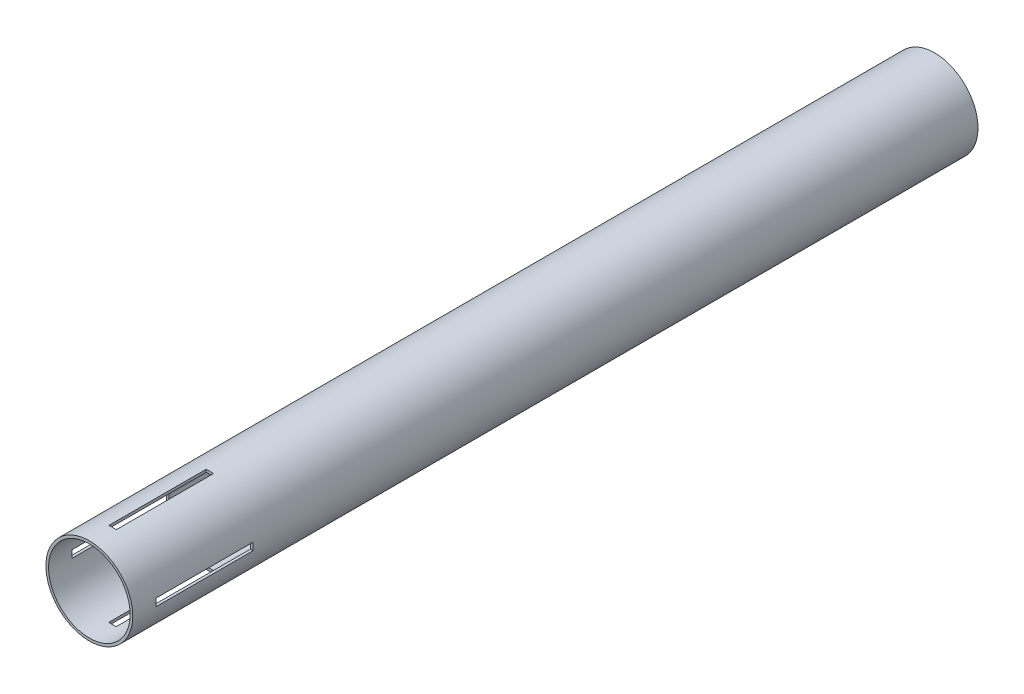
ISO-10303-21;
HEADER;
FILE_DESCRIPTION(('STEP AP214'),'2;1');
FILE_NAME('part.step','',(''),(''),'','','');
FILE_SCHEMA(('AUTOMOTIVE_DESIGN { 1 0 10303 214 1 1 1 1 }'));
ENDSEC;
DATA;
#1=APPLICATION_CONTEXT('core data for automotive mechanical design processes');
#2=APPLICATION_PROTOCOL_DEFINITION('international standard','automotive_design',2000,#1);
#3=PRODUCT_CONTEXT('',#1,'mechanical');
#4=PRODUCT('Part','Part','',(#3));
#5=PRODUCT_RELATED_PRODUCT_CATEGORY('part','',(#4));
#6=PRODUCT_DEFINITION_FORMATION('','',#4);
#7=PRODUCT_DEFINITION_CONTEXT('part definition',#1,'design');
#8=PRODUCT_DEFINITION('design','',#6,#7);
#9=PRODUCT_DEFINITION_SHAPE('','',#8);
#10=(LENGTH_UNIT() NAMED_UNIT(*) SI_UNIT(.MILLI.,.METRE.));
#11=(NAMED_UNIT(*) PLANE_ANGLE_UNIT() SI_UNIT($,.RADIAN.));
#12=(NAMED_UNIT(*) SI_UNIT($,.STERADIAN.) SOLID_ANGLE_UNIT());
#13=UNCERTAINTY_MEASURE_WITH_UNIT(LENGTH_MEASURE(1.E-05),#10,'distance_accuracy_value','');
#14=(GEOMETRIC_REPRESENTATION_CONTEXT(3) GLOBAL_UNCERTAINTY_ASSIGNED_CONTEXT((#13)) GLOBAL_UNIT_ASSIGNED_CONTEXT((#10,
#11,#12)) REPRESENTATION_CONTEXT('',''));
#15=CARTESIAN_POINT('',(0.,0.,0.));
#16=DIRECTION('',(0.,0.,1.));
#17=DIRECTION('',(1.,0.,0.));
#18=AXIS2_PLACEMENT_3D('',#15,#16,#17);
#19=CARTESIAN_POINT('',(0.,0.,-400.));
#20=DIRECTION('',(0.,0.,1.));
#21=DIRECTION('',(1.,0.,0.));
#22=AXIS2_PLACEMENT_3D('',#19,#20,#21);
#23=CYLINDRICAL_SURFACE('',#22,20.555);
#24=CARTESIAN_POINT('',(0.,0.,-57.));
#25=DIRECTION('',(0.,0.,-1.));
#26=DIRECTION('',(-1.,0.,0.));
#27=AXIS2_PLACEMENT_3D('',#24,#25,#26);
#28=CIRCLE('',#27,20.555);
#29=CARTESIAN_POINT('',(-20.4803692593664,1.75000000000008,-57.));
#30=VERTEX_POINT('',#29);
#31=CARTESIAN_POINT('',(-20.4803692593664,-1.74999999999992,-57.));
#32=VERTEX_POINT('',#31);
#33=EDGE_CURVE('E54',#30,#32,#28,.F.);
#34=ORIENTED_EDGE('',*,*,#33,.F.);
#35=DIRECTION('',(0.,0.,1.));
#36=VECTOR('',#35,1.);
#37=CARTESIAN_POINT('',(-20.4803692593664,1.75000000000017,-400.));
#38=LINE('',#37,#36);
#39=CARTESIAN_POINT('',(-20.4803692593664,1.75000000000007,-11.));
#40=VERTEX_POINT('',#39);
#41=EDGE_CURVE('E171',#40,#30,#38,.F.);
#42=ORIENTED_EDGE('',*,*,#41,.F.);
#43=CARTESIAN_POINT('',(0.,0.,-11.));
#44=DIRECTION('',(0.,0.,1.));
#45=DIRECTION('',(0.,-1.,0.));
#46=AXIS2_PLACEMENT_3D('',#43,#44,#45);
#47=CIRCLE('',#46,20.555);
#48=CARTESIAN_POINT('',(-20.4803692593664,-1.74999999999993,-11.));
#49=VERTEX_POINT('',#48);
#50=EDGE_CURVE('E208',#49,#40,#47,.F.);
#51=ORIENTED_EDGE('',*,*,#50,.F.);
#52=DIRECTION('',(0.,0.,1.));
#53=VECTOR('',#52,1.);
#54=CARTESIAN_POINT('',(-20.4803692593664,-1.74999999999983,-400.));
#55=LINE('',#54,#53);
#56=EDGE_CURVE('E210',#32,#49,#55,.T.);
#57=ORIENTED_EDGE('',*,*,#56,.F.);
#58=EDGE_LOOP('',(#34,#42,#51,#57));
#59=FACE_BOUND('',#58,.T.);
#60=CARTESIAN_POINT('',(20.4803692593664,-1.75000000000006,-57.));
#61=VERTEX_POINT('',#60);
#62=CARTESIAN_POINT('',(20.4803692593664,1.74999999999994,-57.));
#63=VERTEX_POINT('',#62);
#64=EDGE_CURVE('E202',#61,#63,#28,.F.);
#65=ORIENTED_EDGE('',*,*,#64,.F.);
#66=DIRECTION('',(0.,0.,1.));
#67=VECTOR('',#66,1.);
#68=CARTESIAN_POINT('',(20.4803692593664,-1.74999999999997,-400.));
#69=LINE('',#68,#67);
#70=CARTESIAN_POINT('',(20.4803692593664,-1.75000000000007,-11.));
#71=VERTEX_POINT('',#70);
#72=EDGE_CURVE('E198',#71,#61,#69,.F.);
#73=ORIENTED_EDGE('',*,*,#72,.F.);
#74=CARTESIAN_POINT('',(20.4803692593664,1.74999999999993,-11.));
#75=VERTEX_POINT('',#74);
#76=EDGE_CURVE('E207',#75,#71,#47,.F.);
#77=ORIENTED_EDGE('',*,*,#76,.F.);
#78=DIRECTION('',(0.,0.,1.));
#79=VECTOR('',#78,1.);
#80=CARTESIAN_POINT('',(20.4803692593664,1.75000000000003,-400.));
#81=LINE('',#80,#79);
#82=EDGE_CURVE('E204',#63,#75,#81,.T.);
#83=ORIENTED_EDGE('',*,*,#82,.F.);
#84=EDGE_LOOP('',(#65,#73,#77,#83));
#85=FACE_BOUND('',#84,.T.);
#86=CARTESIAN_POINT('',(0.,0.,-57.));
#87=DIRECTION('',(0.,0.,-1.));
#88=DIRECTION('',(-1.,0.,0.));
#89=AXIS2_PLACEMENT_3D('',#86,#87,#88);
#90=CIRCLE('',#89,20.555);
#91=CARTESIAN_POINT('',(-1.75000000000001,-20.4803692593664,-57.));
#92=VERTEX_POINT('',#91);
#93=CARTESIAN_POINT('',(1.74999999999999,-20.4803692593664,-57.));
#94=VERTEX_POINT('',#93);
#95=EDGE_CURVE('E229',#92,#94,#90,.F.);
#96=ORIENTED_EDGE('',*,*,#95,.F.);
#97=DIRECTION('',(0.,0.,1.));
#98=VECTOR('',#97,1.);
#99=CARTESIAN_POINT('',(-1.7500000000001,-20.4803692593664,-400.));
#100=LINE('',#99,#98);
#101=CARTESIAN_POINT('',(-1.75,-20.4803692593664,-11.));
#102=VERTEX_POINT('',#101);
#103=EDGE_CURVE('E234',#102,#92,#100,.F.);
#104=ORIENTED_EDGE('',*,*,#103,.F.);
#105=CARTESIAN_POINT('',(0.,0.,-11.));
#106=DIRECTION('',(0.,0.,1.));
#107=DIRECTION('',(1.,0.,0.));
#108=AXIS2_PLACEMENT_3D('',#105,#106,#107);
#109=CIRCLE('',#108,20.555);
#110=CARTESIAN_POINT('',(1.75,-20.4803692593664,-11.));
#111=VERTEX_POINT('',#110);
#112=EDGE_CURVE('E237',#111,#102,#109,.F.);
#113=ORIENTED_EDGE('',*,*,#112,.F.);
#114=DIRECTION('',(0.,0.,1.));
#115=VECTOR('',#114,1.);
#116=CARTESIAN_POINT('',(1.7499999999999,-20.4803692593664,-400.));
#117=LINE('',#116,#115);
#118=EDGE_CURVE('E239',#94,#111,#117,.T.);
#119=ORIENTED_EDGE('',*,*,#118,.F.);
#120=EDGE_LOOP('',(#96,#104,#113,#119));
#121=FACE_BOUND('',#120,.T.);
#122=CARTESIAN_POINT('',(1.74999999999999,20.4803692593664,-57.));
#123=VERTEX_POINT('',#122);
#124=CARTESIAN_POINT('',(-1.75000000000001,20.4803692593664,-57.));
#125=VERTEX_POINT('',#124);
#126=EDGE_CURVE('E232',#123,#125,#90,.F.);
#127=ORIENTED_EDGE('',*,*,#126,.F.);
#128=DIRECTION('',(0.,0.,1.));
#129=VECTOR('',#128,1.);
#130=CARTESIAN_POINT('',(1.7499999999999,20.4803692593664,-400.));
#131=LINE('',#130,#129);
#132=CARTESIAN_POINT('',(1.75,20.4803692593664,-11.));
#133=VERTEX_POINT('',#132);
#134=EDGE_CURVE('E241',#133,#123,#131,.F.);
#135=ORIENTED_EDGE('',*,*,#134,.F.);
#136=CARTESIAN_POINT('',(-1.75,20.4803692593664,-11.));
#137=VERTEX_POINT('',#136);
#138=EDGE_CURVE('E236',#137,#133,#109,.F.);
#139=ORIENTED_EDGE('',*,*,#138,.F.);
#140=DIRECTION('',(0.,0.,1.));
#141=VECTOR('',#140,1.);
#142=CARTESIAN_POINT('',(-1.7500000000001,20.4803692593664,-400.));
#143=LINE('',#142,#141);
#144=EDGE_CURVE('E231',#125,#137,#143,.T.);
#145=ORIENTED_EDGE('',*,*,#144,.F.);
#146=EDGE_LOOP('',(#127,#135,#139,#145));
#147=FACE_BOUND('',#146,.T.);
#148=CARTESIAN_POINT('',(0.,0.,-400.));
#149=DIRECTION('',(0.,0.,1.));
#150=DIRECTION('',(1.,0.,0.));
#151=AXIS2_PLACEMENT_3D('',#148,#149,#150);
#152=CIRCLE('',#151,20.555);
#153=CARTESIAN_POINT('',(20.555,0.,-400.));
#154=VERTEX_POINT('',#153);
#155=EDGE_CURVE('E250',#154,#154,#152,.T.);
#156=ORIENTED_EDGE('',*,*,#155,.T.);
#157=EDGE_LOOP('',(#156));
#158=FACE_BOUND('',#157,.T.);
#159=CARTESIAN_POINT('',(0.,0.,0.));
#160=DIRECTION('',(0.,0.,1.));
#161=DIRECTION('',(1.,0.,0.));
#162=AXIS2_PLACEMENT_3D('',#159,#160,#161);
#163=CIRCLE('',#162,20.555);
#164=CARTESIAN_POINT('',(20.555,0.,0.));
#165=VERTEX_POINT('',#164);
#166=EDGE_CURVE('E247',#165,#165,#163,.T.);
#167=ORIENTED_EDGE('',*,*,#166,.F.);
#168=EDGE_LOOP('',(#167));
#169=FACE_BOUND('',#168,.T.);
#170=ADVANCED_FACE('F40',(#59,#85,#121,#147,#158,#169),#23,.T.);
#171=CARTESIAN_POINT('',(0.,0.,-400.));
#172=DIRECTION('',(0.,0.,1.));
#173=DIRECTION('',(1.,0.,0.));
#174=AXIS2_PLACEMENT_3D('',#171,#172,#173);
#175=PLANE('',#174);
#176=CARTESIAN_POINT('',(0.,0.,-400.));
#177=DIRECTION('',(0.,0.,1.));
#178=DIRECTION('',(1.,0.,0.));
#179=AXIS2_PLACEMENT_3D('',#176,#177,#178);
#180=CIRCLE('',#179,19.305);
#181=CARTESIAN_POINT('',(19.305,0.,-400.));
#182=VERTEX_POINT('',#181);
#183=EDGE_CURVE('E244',#182,#182,#180,.T.);
#184=ORIENTED_EDGE('',*,*,#183,.T.);
#185=EDGE_LOOP('',(#184));
#186=FACE_BOUND('',#185,.T.);
#187=ORIENTED_EDGE('',*,*,#155,.F.);
#188=EDGE_LOOP('',(#187));
#189=FACE_BOUND('',#188,.T.);
#190=ADVANCED_FACE('F315',(#186,#189),#175,.F.);
#191=CARTESIAN_POINT('',(0.,0.,0.));
#192=DIRECTION('',(0.,0.,1.));
#193=DIRECTION('',(1.,0.,0.));
#194=AXIS2_PLACEMENT_3D('',#191,#192,#193);
#195=PLANE('',#194);
#196=CARTESIAN_POINT('',(0.,0.,0.));
#197=DIRECTION('',(0.,0.,1.));
#198=DIRECTION('',(1.,0.,0.));
#199=AXIS2_PLACEMENT_3D('',#196,#197,#198);
#200=CIRCLE('',#199,19.305);
#201=CARTESIAN_POINT('',(19.305,0.,0.));
#202=VERTEX_POINT('',#201);
#203=EDGE_CURVE('E243',#202,#202,#200,.T.);
#204=ORIENTED_EDGE('',*,*,#203,.F.);
#205=EDGE_LOOP('',(#204));
#206=FACE_BOUND('',#205,.T.);
#207=ORIENTED_EDGE('',*,*,#166,.T.);
#208=EDGE_LOOP('',(#207));
#209=FACE_BOUND('',#208,.T.);
#210=ADVANCED_FACE('F307',(#206,#209),#195,.T.);
#211=CARTESIAN_POINT('',(0.,0.,-400.));
#212=DIRECTION('',(0.,0.,1.));
#213=DIRECTION('',(1.,0.,0.));
#214=AXIS2_PLACEMENT_3D('',#211,#212,#213);
#215=CYLINDRICAL_SURFACE('',#214,19.305);
#216=CARTESIAN_POINT('',(0.,0.,-11.));
#217=DIRECTION('',(0.,0.,1.));
#218=DIRECTION('',(0.,-1.,0.));
#219=AXIS2_PLACEMENT_3D('',#216,#217,#218);
#220=CIRCLE('',#219,19.305);
#221=CARTESIAN_POINT('',(19.2255175483002,1.74999999999993,-11.));
#222=VERTEX_POINT('',#221);
#223=CARTESIAN_POINT('',(19.2255175483002,-1.75000000000007,-11.));
#224=VERTEX_POINT('',#223);
#225=EDGE_CURVE('E47',#222,#224,#220,.F.);
#226=ORIENTED_EDGE('',*,*,#225,.T.);
#227=DIRECTION('',(0.,0.,1.));
#228=VECTOR('',#227,1.);
#229=CARTESIAN_POINT('',(19.2255175483002,-1.74999999999997,-400.));
#230=LINE('',#229,#228);
#231=CARTESIAN_POINT('',(19.2255175483002,-1.75000000000006,-57.));
#232=VERTEX_POINT('',#231);
#233=EDGE_CURVE('E11',#224,#232,#230,.F.);
#234=ORIENTED_EDGE('',*,*,#233,.T.);
#235=CARTESIAN_POINT('',(0.,0.,-57.));
#236=DIRECTION('',(0.,0.,-1.));
#237=DIRECTION('',(-1.,0.,0.));
#238=AXIS2_PLACEMENT_3D('',#235,#236,#237);
#239=CIRCLE('',#238,19.305);
#240=CARTESIAN_POINT('',(19.2255175483002,1.74999999999994,-57.));
#241=VERTEX_POINT('',#240);
#242=EDGE_CURVE('E166',#232,#241,#239,.F.);
#243=ORIENTED_EDGE('',*,*,#242,.T.);
#244=DIRECTION('',(0.,0.,1.));
#245=VECTOR('',#244,1.);
#246=CARTESIAN_POINT('',(19.2255175483002,1.75000000000003,-400.));
#247=LINE('',#246,#245);
#248=EDGE_CURVE('E183',#241,#222,#247,.T.);
#249=ORIENTED_EDGE('',*,*,#248,.T.);
#250=EDGE_LOOP('',(#226,#234,#243,#249));
#251=FACE_BOUND('',#250,.T.);
#252=CARTESIAN_POINT('',(-19.2255175483002,1.75000000000008,-57.));
#253=VERTEX_POINT('',#252);
#254=CARTESIAN_POINT('',(-19.2255175483002,-1.74999999999992,-57.));
#255=VERTEX_POINT('',#254);
#256=EDGE_CURVE('E152',#253,#255,#239,.F.);
#257=ORIENTED_EDGE('',*,*,#256,.T.);
#258=DIRECTION('',(0.,0.,1.));
#259=VECTOR('',#258,1.);
#260=CARTESIAN_POINT('',(-19.2255175483002,-1.74999999999984,-400.));
#261=LINE('',#260,#259);
#262=CARTESIAN_POINT('',(-19.2255175483002,-1.74999999999993,-11.));
#263=VERTEX_POINT('',#262);
#264=EDGE_CURVE('E179',#255,#263,#261,.T.);
#265=ORIENTED_EDGE('',*,*,#264,.T.);
#266=CARTESIAN_POINT('',(-19.2255175483002,1.75000000000007,-11.));
#267=VERTEX_POINT('',#266);
#268=EDGE_CURVE('E177',#263,#267,#220,.F.);
#269=ORIENTED_EDGE('',*,*,#268,.T.);
#270=DIRECTION('',(0.,0.,1.));
#271=VECTOR('',#270,1.);
#272=CARTESIAN_POINT('',(-19.2255175483002,1.75000000000016,-400.));
#273=LINE('',#272,#271);
#274=EDGE_CURVE('E163',#267,#253,#273,.F.);
#275=ORIENTED_EDGE('',*,*,#274,.T.);
#276=EDGE_LOOP('',(#257,#265,#269,#275));
#277=FACE_BOUND('',#276,.T.);
#278=CARTESIAN_POINT('',(0.,0.,-57.));
#279=DIRECTION('',(0.,0.,-1.));
#280=DIRECTION('',(-1.,0.,0.));
#281=AXIS2_PLACEMENT_3D('',#278,#279,#280);
#282=CIRCLE('',#281,19.305);
#283=CARTESIAN_POINT('',(-1.75000000000001,-19.2255175483002,-57.));
#284=VERTEX_POINT('',#283);
#285=CARTESIAN_POINT('',(1.74999999999999,-19.2255175483002,-57.));
#286=VERTEX_POINT('',#285);
#287=EDGE_CURVE('E259',#284,#286,#282,.F.);
#288=ORIENTED_EDGE('',*,*,#287,.T.);
#289=DIRECTION('',(0.,0.,1.));
#290=VECTOR('',#289,1.);
#291=CARTESIAN_POINT('',(1.7499999999999,-19.2255175483002,-400.));
#292=LINE('',#291,#290);
#293=CARTESIAN_POINT('',(1.75,-19.2255175483002,-11.));
#294=VERTEX_POINT('',#293);
#295=EDGE_CURVE('E164',#286,#294,#292,.T.);
#296=ORIENTED_EDGE('',*,*,#295,.T.);
#297=CARTESIAN_POINT('',(0.,0.,-11.));
#298=DIRECTION('',(0.,0.,1.));
#299=DIRECTION('',(1.,0.,0.));
#300=AXIS2_PLACEMENT_3D('',#297,#298,#299);
#301=CIRCLE('',#300,19.305);
#302=CARTESIAN_POINT('',(-1.75,-19.2255175483002,-11.));
#303=VERTEX_POINT('',#302);
#304=EDGE_CURVE('E266',#294,#303,#301,.F.);
#305=ORIENTED_EDGE('',*,*,#304,.T.);
#306=DIRECTION('',(0.,0.,1.));
#307=VECTOR('',#306,1.);
#308=CARTESIAN_POINT('',(-1.7500000000001,-19.2255175483002,-400.));
#309=LINE('',#308,#307);
#310=EDGE_CURVE('E269',#303,#284,#309,.F.);
#311=ORIENTED_EDGE('',*,*,#310,.T.);
#312=EDGE_LOOP('',(#288,#296,#305,#311));
#313=FACE_BOUND('',#312,.T.);
#314=CARTESIAN_POINT('',(-1.75,19.2255175483002,-11.));
#315=VERTEX_POINT('',#314);
#316=CARTESIAN_POINT('',(1.75,19.2255175483002,-11.));
#317=VERTEX_POINT('',#316);
#318=EDGE_CURVE('E262',#315,#317,#301,.F.);
#319=ORIENTED_EDGE('',*,*,#318,.T.);
#320=DIRECTION('',(0.,0.,1.));
#321=VECTOR('',#320,1.);
#322=CARTESIAN_POINT('',(1.7499999999999,19.2255175483002,-400.));
#323=LINE('',#322,#321);
#324=CARTESIAN_POINT('',(1.74999999999999,19.2255175483002,-57.));
#325=VERTEX_POINT('',#324);
#326=EDGE_CURVE('E265',#317,#325,#323,.F.);
#327=ORIENTED_EDGE('',*,*,#326,.T.);
#328=CARTESIAN_POINT('',(-1.75000000000001,19.2255175483002,-57.));
#329=VERTEX_POINT('',#328);
#330=EDGE_CURVE('E253',#325,#329,#282,.F.);
#331=ORIENTED_EDGE('',*,*,#330,.T.);
#332=DIRECTION('',(0.,0.,1.));
#333=VECTOR('',#332,1.);
#334=CARTESIAN_POINT('',(-1.7500000000001,19.2255175483002,-400.));
#335=LINE('',#334,#333);
#336=EDGE_CURVE('E258',#329,#315,#335,.T.);
#337=ORIENTED_EDGE('',*,*,#336,.T.);
#338=EDGE_LOOP('',(#319,#327,#331,#337));
#339=FACE_BOUND('',#338,.T.);
#340=ORIENTED_EDGE('',*,*,#183,.F.);
#341=EDGE_LOOP('',(#340));
#342=FACE_BOUND('',#341,.T.);
#343=ORIENTED_EDGE('',*,*,#203,.T.);
#344=EDGE_LOOP('',(#343));
#345=FACE_BOUND('',#344,.T.);
#346=ADVANCED_FACE('F175',(#251,#277,#313,#339,#342,#345),#215,.F.);
#347=CARTESIAN_POINT('',(-1.75000000000001,-20.555,-57.));
#348=DIRECTION('',(0.,0.,-1.));
#349=DIRECTION('',(-1.,0.,0.));
#350=AXIS2_PLACEMENT_3D('',#347,#348,#349);
#351=PLANE('',#350);
#352=ORIENTED_EDGE('',*,*,#126,.T.);
#353=DIRECTION('',(0.,1.,0.));
#354=VECTOR('',#353,1.);
#355=CARTESIAN_POINT('',(-1.75000000000001,-20.555,-57.));
#356=LINE('',#355,#354);
#357=EDGE_CURVE('E223',#329,#125,#356,.T.);
#358=ORIENTED_EDGE('',*,*,#357,.F.);
#359=ORIENTED_EDGE('',*,*,#330,.F.);
#360=DIRECTION('',(0.,1.,0.));
#361=VECTOR('',#360,1.);
#362=CARTESIAN_POINT('',(1.74999999999999,-20.555,-57.));
#363=LINE('',#362,#361);
#364=EDGE_CURVE('E213',#325,#123,#363,.T.);
#365=ORIENTED_EDGE('',*,*,#364,.T.);
#366=EDGE_LOOP('',(#352,#358,#359,#365));
#367=FACE_BOUND('',#366,.T.);
#368=ADVANCED_FACE('F289',(#367),#351,.F.);
#369=CARTESIAN_POINT('',(-1.75000000000001,-20.555,-57.));
#370=DIRECTION('',(-1.,0.,0.));
#371=DIRECTION('',(0.,0.,1.));
#372=AXIS2_PLACEMENT_3D('',#369,#370,#371);
#373=PLANE('',#372);
#374=ORIENTED_EDGE('',*,*,#144,.T.);
#375=DIRECTION('',(0.,1.,0.));
#376=VECTOR('',#375,1.);
#377=CARTESIAN_POINT('',(-1.75,-20.555,-11.));
#378=LINE('',#377,#376);
#379=EDGE_CURVE('E219',#315,#137,#378,.T.);
#380=ORIENTED_EDGE('',*,*,#379,.F.);
#381=ORIENTED_EDGE('',*,*,#336,.F.);
#382=ORIENTED_EDGE('',*,*,#357,.T.);
#383=EDGE_LOOP('',(#374,#380,#381,#382));
#384=FACE_BOUND('',#383,.T.);
#385=ADVANCED_FACE('F296',(#384),#373,.F.);
#386=CARTESIAN_POINT('',(-1.75,-20.555,-11.));
#387=DIRECTION('',(0.,0.,1.));
#388=DIRECTION('',(1.,0.,0.));
#389=AXIS2_PLACEMENT_3D('',#386,#387,#388);
#390=PLANE('',#389);
#391=ORIENTED_EDGE('',*,*,#138,.T.);
#392=DIRECTION('',(0.,1.,0.));
#393=VECTOR('',#392,1.);
#394=CARTESIAN_POINT('',(1.75,-20.555,-11.));
#395=LINE('',#394,#393);
#396=EDGE_CURVE('E214',#317,#133,#395,.T.);
#397=ORIENTED_EDGE('',*,*,#396,.F.);
#398=ORIENTED_EDGE('',*,*,#318,.F.);
#399=ORIENTED_EDGE('',*,*,#379,.T.);
#400=EDGE_LOOP('',(#391,#397,#398,#399));
#401=FACE_BOUND('',#400,.T.);
#402=ADVANCED_FACE('F302',(#401),#390,.F.);
#403=CARTESIAN_POINT('',(1.74999999999999,-20.555,-57.));
#404=DIRECTION('',(1.,0.,0.));
#405=DIRECTION('',(0.,0.,-1.));
#406=AXIS2_PLACEMENT_3D('',#403,#404,#405);
#407=PLANE('',#406);
#408=ORIENTED_EDGE('',*,*,#134,.T.);
#409=ORIENTED_EDGE('',*,*,#364,.F.);
#410=ORIENTED_EDGE('',*,*,#326,.F.);
#411=ORIENTED_EDGE('',*,*,#396,.T.);
#412=EDGE_LOOP('',(#408,#409,#410,#411));
#413=FACE_BOUND('',#412,.T.);
#414=ADVANCED_FACE('F304',(#413),#407,.F.);
#415=ORIENTED_EDGE('',*,*,#118,.T.);
#416=EDGE_CURVE('E217',#111,#294,#395,.T.);
#417=ORIENTED_EDGE('',*,*,#416,.T.);
#418=ORIENTED_EDGE('',*,*,#295,.F.);
#419=EDGE_CURVE('E226',#94,#286,#363,.T.);
#420=ORIENTED_EDGE('',*,*,#419,.F.);
#421=EDGE_LOOP('',(#415,#417,#418,#420));
#422=FACE_BOUND('',#421,.T.);
#423=ADVANCED_FACE('F284',(#422),#407,.F.);
#424=ORIENTED_EDGE('',*,*,#112,.T.);
#425=EDGE_CURVE('E218',#102,#303,#378,.T.);
#426=ORIENTED_EDGE('',*,*,#425,.T.);
#427=ORIENTED_EDGE('',*,*,#304,.F.);
#428=ORIENTED_EDGE('',*,*,#416,.F.);
#429=EDGE_LOOP('',(#424,#426,#427,#428));
#430=FACE_BOUND('',#429,.T.);
#431=ADVANCED_FACE('F280',(#430),#390,.F.);
#432=ORIENTED_EDGE('',*,*,#103,.T.);
#433=EDGE_CURVE('E222',#92,#284,#356,.T.);
#434=ORIENTED_EDGE('',*,*,#433,.T.);
#435=ORIENTED_EDGE('',*,*,#310,.F.);
#436=ORIENTED_EDGE('',*,*,#425,.F.);
#437=EDGE_LOOP('',(#432,#434,#435,#436));
#438=FACE_BOUND('',#437,.T.);
#439=ADVANCED_FACE('F334',(#438),#373,.F.);
#440=ORIENTED_EDGE('',*,*,#95,.T.);
#441=ORIENTED_EDGE('',*,*,#419,.T.);
#442=ORIENTED_EDGE('',*,*,#287,.F.);
#443=ORIENTED_EDGE('',*,*,#433,.F.);
#444=EDGE_LOOP('',(#440,#441,#442,#443));
#445=FACE_BOUND('',#444,.T.);
#446=ADVANCED_FACE('F331',(#445),#351,.F.);
#447=CARTESIAN_POINT('',(-20.5550000000001,1.75000000000008,-57.));
#448=DIRECTION('',(0.,0.,-1.));
#449=DIRECTION('',(-1.,0.,0.));
#450=AXIS2_PLACEMENT_3D('',#447,#448,#449);
#451=PLANE('',#450);
#452=ORIENTED_EDGE('',*,*,#33,.T.);
#453=DIRECTION('',(1.,0.,0.));
#454=VECTOR('',#453,1.);
#455=CARTESIAN_POINT('',(-20.5550000000001,-1.74999999999992,-57.));
#456=LINE('',#455,#454);
#457=EDGE_CURVE('E158',#32,#255,#456,.T.);
#458=ORIENTED_EDGE('',*,*,#457,.T.);
#459=ORIENTED_EDGE('',*,*,#256,.F.);
#460=DIRECTION('',(1.,0.,0.));
#461=VECTOR('',#460,1.);
#462=CARTESIAN_POINT('',(-20.5550000000001,1.75000000000008,-57.));
#463=LINE('',#462,#461);
#464=EDGE_CURVE('E155',#30,#253,#463,.T.);
#465=ORIENTED_EDGE('',*,*,#464,.F.);
#466=EDGE_LOOP('',(#452,#458,#459,#465));
#467=FACE_BOUND('',#466,.T.);
#468=ADVANCED_FACE('F154',(#467),#451,.F.);
#469=CARTESIAN_POINT('',(-20.5550000000001,1.75000000000008,-57.));
#470=DIRECTION('',(0.,1.,0.));
#471=DIRECTION('',(-1.,0.,0.));
#472=AXIS2_PLACEMENT_3D('',#469,#470,#471);
#473=PLANE('',#472);
#474=ORIENTED_EDGE('',*,*,#41,.T.);
#475=ORIENTED_EDGE('',*,*,#464,.T.);
#476=ORIENTED_EDGE('',*,*,#274,.F.);
#477=DIRECTION('',(1.,0.,0.));
#478=VECTOR('',#477,1.);
#479=CARTESIAN_POINT('',(-20.5550000000001,1.75000000000007,-11.));
#480=LINE('',#479,#478);
#481=EDGE_CURVE('E530',#40,#267,#480,.T.);
#482=ORIENTED_EDGE('',*,*,#481,.F.);
#483=EDGE_LOOP('',(#474,#475,#476,#482));
#484=FACE_BOUND('',#483,.T.);
#485=ADVANCED_FACE('F168',(#484),#473,.F.);
#486=CARTESIAN_POINT('',(-20.5550000000001,1.75000000000007,-11.));
#487=DIRECTION('',(0.,0.,1.));
#488=DIRECTION('',(0.,-1.,0.));
#489=AXIS2_PLACEMENT_3D('',#486,#487,#488);
#490=PLANE('',#489);
#491=ORIENTED_EDGE('',*,*,#50,.T.);
#492=ORIENTED_EDGE('',*,*,#481,.T.);
#493=ORIENTED_EDGE('',*,*,#268,.F.);
#494=DIRECTION('',(1.,0.,0.));
#495=VECTOR('',#494,1.);
#496=CARTESIAN_POINT('',(-20.5550000000001,-1.74999999999993,-11.));
#497=LINE('',#496,#495);
#498=EDGE_CURVE('E533',#49,#263,#497,.T.);
#499=ORIENTED_EDGE('',*,*,#498,.F.);
#500=EDGE_LOOP('',(#491,#492,#493,#499));
#501=FACE_BOUND('',#500,.T.);
#502=ADVANCED_FACE('F409',(#501),#490,.F.);
#503=CARTESIAN_POINT('',(-20.5550000000001,-1.74999999999992,-57.));
#504=DIRECTION('',(0.,-1.,0.));
#505=DIRECTION('',(1.,0.,0.));
#506=AXIS2_PLACEMENT_3D('',#503,#504,#505);
#507=PLANE('',#506);
#508=ORIENTED_EDGE('',*,*,#56,.T.);
#509=ORIENTED_EDGE('',*,*,#498,.T.);
#510=ORIENTED_EDGE('',*,*,#264,.F.);
#511=ORIENTED_EDGE('',*,*,#457,.F.);
#512=EDGE_LOOP('',(#508,#509,#510,#511));
#513=FACE_BOUND('',#512,.T.);
#514=ADVANCED_FACE('F420',(#513),#507,.F.);
#515=ORIENTED_EDGE('',*,*,#72,.T.);
#516=EDGE_CURVE('E191',#232,#61,#456,.T.);
#517=ORIENTED_EDGE('',*,*,#516,.F.);
#518=ORIENTED_EDGE('',*,*,#233,.F.);
#519=EDGE_CURVE('E531',#224,#71,#497,.T.);
#520=ORIENTED_EDGE('',*,*,#519,.T.);
#521=EDGE_LOOP('',(#515,#517,#518,#520));
#522=FACE_BOUND('',#521,.T.);
#523=ADVANCED_FACE('F194',(#522),#507,.F.);
#524=ORIENTED_EDGE('',*,*,#76,.T.);
#525=ORIENTED_EDGE('',*,*,#519,.F.);
#526=ORIENTED_EDGE('',*,*,#225,.F.);
#527=EDGE_CURVE('E172',#222,#75,#480,.T.);
#528=ORIENTED_EDGE('',*,*,#527,.T.);
#529=EDGE_LOOP('',(#524,#525,#526,#528));
#530=FACE_BOUND('',#529,.T.);
#531=ADVANCED_FACE('F423',(#530),#490,.F.);
#532=ORIENTED_EDGE('',*,*,#82,.T.);
#533=ORIENTED_EDGE('',*,*,#527,.F.);
#534=ORIENTED_EDGE('',*,*,#248,.F.);
#535=EDGE_CURVE('E62',#241,#63,#463,.T.);
#536=ORIENTED_EDGE('',*,*,#535,.T.);
#537=EDGE_LOOP('',(#532,#533,#534,#536));
#538=FACE_BOUND('',#537,.T.);
#539=ADVANCED_FACE('F411',(#538),#473,.F.);
#540=ORIENTED_EDGE('',*,*,#64,.T.);
#541=ORIENTED_EDGE('',*,*,#535,.F.);
#542=ORIENTED_EDGE('',*,*,#242,.F.);
#543=ORIENTED_EDGE('',*,*,#516,.T.);
#544=EDGE_LOOP('',(#540,#541,#542,#543));
#545=FACE_BOUND('',#544,.T.);
#546=ADVANCED_FACE('F190',(#545),#451,.F.);
#547=CLOSED_SHELL('',(#170,#190,#210,#346,#368,#385,#402,#414,#423,#431,#439,#446,#468,#485,
#502,#514,#523,#531,#539,#546));
#548=MANIFOLD_SOLID_BREP('B2',#547);
#549=ADVANCED_BREP_SHAPE_REPRESENTATION('',(#18,#548),#14);
#550=SHAPE_DEFINITION_REPRESENTATION(#9,#549);
ENDSEC;
END-ISO-10303-21;
